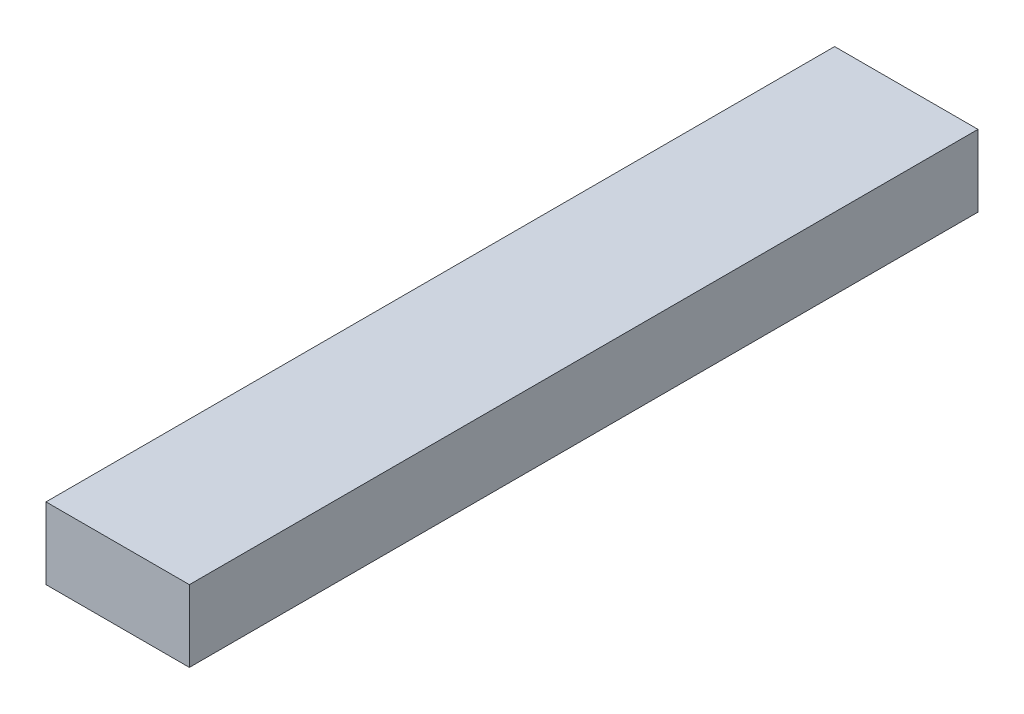
ISO-10303-21;
HEADER;
FILE_DESCRIPTION(('STEP AP214'),'2;1');
FILE_NAME('part.step','',(''),(''),'','','');
FILE_SCHEMA(('AUTOMOTIVE_DESIGN { 1 0 10303 214 1 1 1 1 }'));
ENDSEC;
DATA;
#1=APPLICATION_CONTEXT('core data for automotive mechanical design processes');
#2=APPLICATION_PROTOCOL_DEFINITION('international standard','automotive_design',2000,#1);
#3=PRODUCT_CONTEXT('',#1,'mechanical');
#4=PRODUCT('Part','Part','',(#3));
#5=PRODUCT_RELATED_PRODUCT_CATEGORY('part','',(#4));
#6=PRODUCT_DEFINITION_FORMATION('','',#4);
#7=PRODUCT_DEFINITION_CONTEXT('part definition',#1,'design');
#8=PRODUCT_DEFINITION('design','',#6,#7);
#9=PRODUCT_DEFINITION_SHAPE('','',#8);
#10=(LENGTH_UNIT() NAMED_UNIT(*) SI_UNIT(.MILLI.,.METRE.));
#11=(NAMED_UNIT(*) PLANE_ANGLE_UNIT() SI_UNIT($,.RADIAN.));
#12=(NAMED_UNIT(*) SI_UNIT($,.STERADIAN.) SOLID_ANGLE_UNIT());
#13=UNCERTAINTY_MEASURE_WITH_UNIT(LENGTH_MEASURE(1.E-05),#10,'distance_accuracy_value','');
#14=(GEOMETRIC_REPRESENTATION_CONTEXT(3) GLOBAL_UNCERTAINTY_ASSIGNED_CONTEXT((#13)) GLOBAL_UNIT_ASSIGNED_CONTEXT((#10,
#11,#12)) REPRESENTATION_CONTEXT('',''));
#15=CARTESIAN_POINT('',(0.,0.,0.));
#16=DIRECTION('',(0.,0.,1.));
#17=DIRECTION('',(1.,0.,0.));
#18=AXIS2_PLACEMENT_3D('',#15,#16,#17);
#19=CARTESIAN_POINT('',(-10.,10.,-55.));
#20=DIRECTION('',(1.,0.,0.));
#21=DIRECTION('',(0.,0.,-1.));
#22=AXIS2_PLACEMENT_3D('',#19,#20,#21);
#23=PLANE('',#22);
#24=DIRECTION('',(0.,0.,1.));
#25=VECTOR('',#24,1.);
#26=CARTESIAN_POINT('',(-10.,0.,-55.));
#27=LINE('',#26,#25);
#28=CARTESIAN_POINT('',(-10.,0.,-55.));
#29=VERTEX_POINT('',#28);
#30=CARTESIAN_POINT('',(-10.,0.,55.));
#31=VERTEX_POINT('',#30);
#32=EDGE_CURVE('E96',#29,#31,#27,.T.);
#33=ORIENTED_EDGE('',*,*,#32,.T.);
#34=DIRECTION('',(0.,-1.,0.));
#35=VECTOR('',#34,1.);
#36=CARTESIAN_POINT('',(-10.,10.,55.));
#37=LINE('',#36,#35);
#38=CARTESIAN_POINT('',(-10.,10.,55.));
#39=VERTEX_POINT('',#38);
#40=EDGE_CURVE('E11',#39,#31,#37,.T.);
#41=ORIENTED_EDGE('',*,*,#40,.F.);
#42=DIRECTION('',(0.,0.,1.));
#43=VECTOR('',#42,1.);
#44=CARTESIAN_POINT('',(-10.,10.,-55.));
#45=LINE('',#44,#43);
#46=CARTESIAN_POINT('',(-10.,10.,-55.));
#47=VERTEX_POINT('',#46);
#48=EDGE_CURVE('E84',#47,#39,#45,.T.);
#49=ORIENTED_EDGE('',*,*,#48,.F.);
#50=DIRECTION('',(0.,-1.,0.));
#51=VECTOR('',#50,1.);
#52=CARTESIAN_POINT('',(-10.,10.,-55.));
#53=LINE('',#52,#51);
#54=EDGE_CURVE('E92',#47,#29,#53,.T.);
#55=ORIENTED_EDGE('',*,*,#54,.T.);
#56=EDGE_LOOP('',(#33,#41,#49,#55));
#57=FACE_BOUND('',#56,.T.);
#58=ADVANCED_FACE('F33',(#57),#23,.F.);
#59=CARTESIAN_POINT('',(-10.,10.,55.));
#60=DIRECTION('',(0.,0.,-1.));
#61=DIRECTION('',(-1.,0.,0.));
#62=AXIS2_PLACEMENT_3D('',#59,#60,#61);
#63=PLANE('',#62);
#64=DIRECTION('',(1.,0.,0.));
#65=VECTOR('',#64,1.);
#66=CARTESIAN_POINT('',(-10.,0.,55.));
#67=LINE('',#66,#65);
#68=CARTESIAN_POINT('',(10.,0.,55.));
#69=VERTEX_POINT('',#68);
#70=EDGE_CURVE('E88',#31,#69,#67,.T.);
#71=ORIENTED_EDGE('',*,*,#70,.T.);
#72=DIRECTION('',(0.,-1.,0.));
#73=VECTOR('',#72,1.);
#74=CARTESIAN_POINT('',(10.,10.,55.));
#75=LINE('',#74,#73);
#76=CARTESIAN_POINT('',(10.,10.,55.));
#77=VERTEX_POINT('',#76);
#78=EDGE_CURVE('E41',#77,#69,#75,.T.);
#79=ORIENTED_EDGE('',*,*,#78,.F.);
#80=DIRECTION('',(1.,0.,0.));
#81=VECTOR('',#80,1.);
#82=CARTESIAN_POINT('',(-10.,10.,55.));
#83=LINE('',#82,#81);
#84=EDGE_CURVE('E79',#39,#77,#83,.T.);
#85=ORIENTED_EDGE('',*,*,#84,.F.);
#86=ORIENTED_EDGE('',*,*,#40,.T.);
#87=EDGE_LOOP('',(#71,#79,#85,#86));
#88=FACE_BOUND('',#87,.T.);
#89=ADVANCED_FACE('F87',(#88),#63,.F.);
#90=CARTESIAN_POINT('',(9.99999999999999,10.,-55.));
#91=DIRECTION('',(-1.,0.,0.));
#92=DIRECTION('',(0.,0.,1.));
#93=AXIS2_PLACEMENT_3D('',#90,#91,#92);
#94=PLANE('',#93);
#95=DIRECTION('',(0.,0.,-1.));
#96=VECTOR('',#95,1.);
#97=CARTESIAN_POINT('',(9.99999999999999,0.,-55.));
#98=LINE('',#97,#96);
#99=CARTESIAN_POINT('',(9.99999999999999,0.,-55.));
#100=VERTEX_POINT('',#99);
#101=EDGE_CURVE('E66',#69,#100,#98,.T.);
#102=ORIENTED_EDGE('',*,*,#101,.T.);
#103=DIRECTION('',(0.,-1.,0.));
#104=VECTOR('',#103,1.);
#105=CARTESIAN_POINT('',(9.99999999999999,10.,-55.));
#106=LINE('',#105,#104);
#107=CARTESIAN_POINT('',(9.99999999999999,10.,-55.));
#108=VERTEX_POINT('',#107);
#109=EDGE_CURVE('E89',#108,#100,#106,.T.);
#110=ORIENTED_EDGE('',*,*,#109,.F.);
#111=DIRECTION('',(0.,0.,-1.));
#112=VECTOR('',#111,1.);
#113=CARTESIAN_POINT('',(9.99999999999999,10.,-55.));
#114=LINE('',#113,#112);
#115=EDGE_CURVE('E82',#77,#108,#114,.T.);
#116=ORIENTED_EDGE('',*,*,#115,.F.);
#117=ORIENTED_EDGE('',*,*,#78,.T.);
#118=EDGE_LOOP('',(#102,#110,#116,#117));
#119=FACE_BOUND('',#118,.T.);
#120=ADVANCED_FACE('F90',(#119),#94,.F.);
#121=CARTESIAN_POINT('',(-10.,10.,-55.));
#122=DIRECTION('',(0.,0.,1.));
#123=DIRECTION('',(1.,0.,0.));
#124=AXIS2_PLACEMENT_3D('',#121,#122,#123);
#125=PLANE('',#124);
#126=DIRECTION('',(-1.,0.,0.));
#127=VECTOR('',#126,1.);
#128=CARTESIAN_POINT('',(-10.,0.,-55.));
#129=LINE('',#128,#127);
#130=EDGE_CURVE('E72',#100,#29,#129,.T.);
#131=ORIENTED_EDGE('',*,*,#130,.T.);
#132=ORIENTED_EDGE('',*,*,#54,.F.);
#133=DIRECTION('',(-1.,0.,0.));
#134=VECTOR('',#133,1.);
#135=CARTESIAN_POINT('',(-10.,10.,-55.));
#136=LINE('',#135,#134);
#137=EDGE_CURVE('E49',#108,#47,#136,.T.);
#138=ORIENTED_EDGE('',*,*,#137,.F.);
#139=ORIENTED_EDGE('',*,*,#109,.T.);
#140=EDGE_LOOP('',(#131,#132,#138,#139));
#141=FACE_BOUND('',#140,.T.);
#142=ADVANCED_FACE('F103',(#141),#125,.F.);
#143=CARTESIAN_POINT('',(0.,10.,0.));
#144=DIRECTION('',(0.,1.,0.));
#145=DIRECTION('',(0.,0.,1.));
#146=AXIS2_PLACEMENT_3D('',#143,#144,#145);
#147=PLANE('',#146);
#148=ORIENTED_EDGE('',*,*,#48,.T.);
#149=ORIENTED_EDGE('',*,*,#84,.T.);
#150=ORIENTED_EDGE('',*,*,#115,.T.);
#151=ORIENTED_EDGE('',*,*,#137,.T.);
#152=EDGE_LOOP('',(#148,#149,#150,#151));
#153=FACE_BOUND('',#152,.T.);
#154=ADVANCED_FACE('F80',(#153),#147,.T.);
#155=CARTESIAN_POINT('',(0.,0.,0.));
#156=DIRECTION('',(0.,1.,0.));
#157=DIRECTION('',(0.,0.,1.));
#158=AXIS2_PLACEMENT_3D('',#155,#156,#157);
#159=PLANE('',#158);
#160=ORIENTED_EDGE('',*,*,#32,.F.);
#161=ORIENTED_EDGE('',*,*,#130,.F.);
#162=ORIENTED_EDGE('',*,*,#101,.F.);
#163=ORIENTED_EDGE('',*,*,#70,.F.);
#164=EDGE_LOOP('',(#160,#161,#162,#163));
#165=FACE_BOUND('',#164,.T.);
#166=ADVANCED_FACE('F106',(#165),#159,.F.);
#167=CLOSED_SHELL('',(#58,#89,#120,#142,#154,#166));
#168=MANIFOLD_SOLID_BREP('B2',#167);
#169=ADVANCED_BREP_SHAPE_REPRESENTATION('',(#18,#168),#14);
#170=SHAPE_DEFINITION_REPRESENTATION(#9,#169);
ENDSEC;
END-ISO-10303-21;
